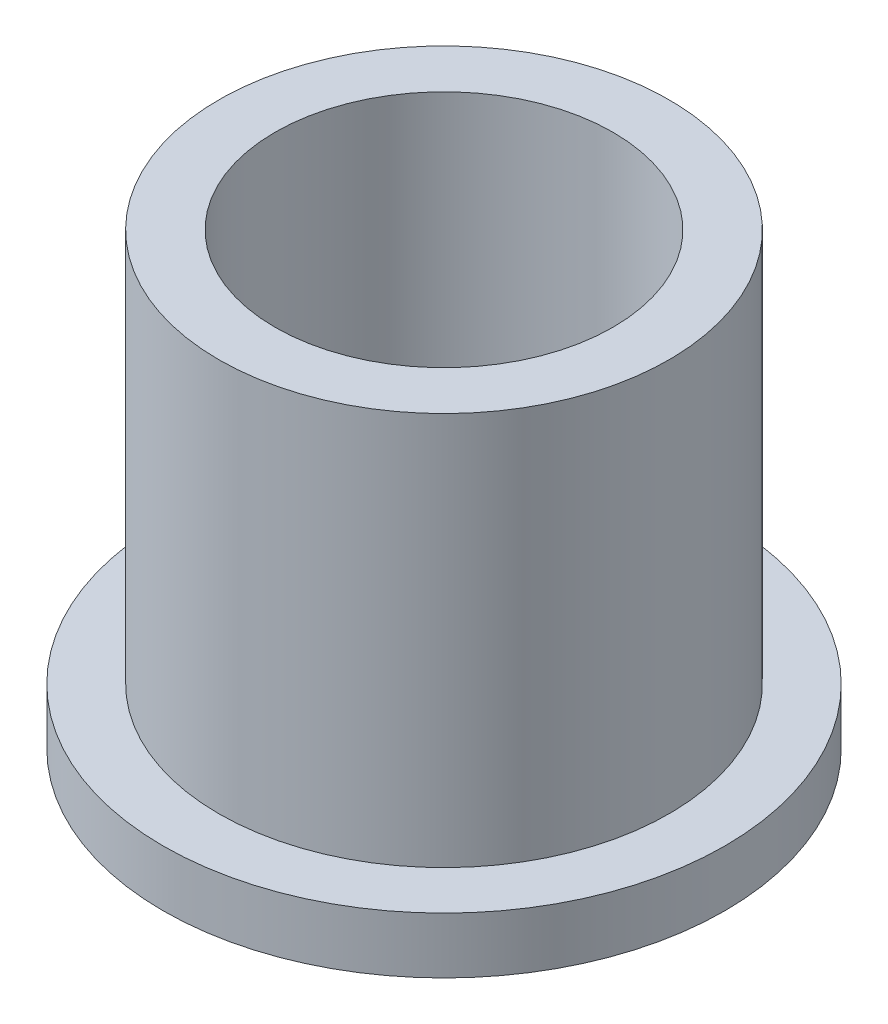
ISO-10303-21;
HEADER;
FILE_DESCRIPTION(('STEP AP214'),'2;1');
FILE_NAME('part.step','',(''),(''),'','','');
FILE_SCHEMA(('AUTOMOTIVE_DESIGN { 1 0 10303 214 1 1 1 1 }'));
ENDSEC;
DATA;
#1=APPLICATION_CONTEXT('core data for automotive mechanical design processes');
#2=APPLICATION_PROTOCOL_DEFINITION('international standard','automotive_design',2000,#1);
#3=PRODUCT_CONTEXT('',#1,'mechanical');
#4=PRODUCT('Part','Part','',(#3));
#5=PRODUCT_RELATED_PRODUCT_CATEGORY('part','',(#4));
#6=PRODUCT_DEFINITION_FORMATION('','',#4);
#7=PRODUCT_DEFINITION_CONTEXT('part definition',#1,'design');
#8=PRODUCT_DEFINITION('design','',#6,#7);
#9=PRODUCT_DEFINITION_SHAPE('','',#8);
#10=(LENGTH_UNIT() NAMED_UNIT(*) SI_UNIT(.MILLI.,.METRE.));
#11=(NAMED_UNIT(*) PLANE_ANGLE_UNIT() SI_UNIT($,.RADIAN.));
#12=(NAMED_UNIT(*) SI_UNIT($,.STERADIAN.) SOLID_ANGLE_UNIT());
#13=UNCERTAINTY_MEASURE_WITH_UNIT(LENGTH_MEASURE(1.E-05),#10,'distance_accuracy_value','');
#14=(GEOMETRIC_REPRESENTATION_CONTEXT(3) GLOBAL_UNCERTAINTY_ASSIGNED_CONTEXT((#13)) GLOBAL_UNIT_ASSIGNED_CONTEXT((#10,
#11,#12)) REPRESENTATION_CONTEXT('',''));
#15=CARTESIAN_POINT('',(0.,0.,0.));
#16=DIRECTION('',(0.,0.,1.));
#17=DIRECTION('',(1.,0.,0.));
#18=AXIS2_PLACEMENT_3D('',#15,#16,#17);
#19=CARTESIAN_POINT('',(0.,12.7,0.));
#20=DIRECTION('',(0.,1.,0.));
#21=DIRECTION('',(0.,0.,1.));
#22=AXIS2_PLACEMENT_3D('',#19,#20,#21);
#23=PLANE('',#22);
#24=CARTESIAN_POINT('',(0.,12.7,0.));
#25=DIRECTION('',(0.,1.,0.));
#26=DIRECTION('',(0.,0.,1.));
#27=AXIS2_PLACEMENT_3D('',#24,#25,#26);
#28=CIRCLE('',#27,6.3627);
#29=CARTESIAN_POINT('',(0.,12.7,6.3627));
#30=VERTEX_POINT('',#29);
#31=EDGE_CURVE('E10',#30,#30,#28,.T.);
#32=ORIENTED_EDGE('',*,*,#31,.T.);
#33=EDGE_LOOP('',(#32));
#34=FACE_BOUND('',#33,.T.);
#35=CARTESIAN_POINT('',(0.,12.7,0.));
#36=DIRECTION('',(0.,1.,0.));
#37=DIRECTION('',(0.,0.,1.));
#38=AXIS2_PLACEMENT_3D('',#35,#36,#37);
#39=CIRCLE('',#38,4.7752);
#40=CARTESIAN_POINT('',(0.,12.7,4.7752));
#41=VERTEX_POINT('',#40);
#42=EDGE_CURVE('E39',#41,#41,#39,.T.);
#43=ORIENTED_EDGE('',*,*,#42,.F.);
#44=EDGE_LOOP('',(#43));
#45=FACE_BOUND('',#44,.T.);
#46=ADVANCED_FACE('F32',(#34,#45),#23,.T.);
#47=CARTESIAN_POINT('',(0.,0.,0.));
#48=DIRECTION('',(0.,1.,0.));
#49=DIRECTION('',(0.,0.,1.));
#50=AXIS2_PLACEMENT_3D('',#47,#48,#49);
#51=PLANE('',#50);
#52=CARTESIAN_POINT('',(0.,0.,0.));
#53=DIRECTION('',(0.,1.,0.));
#54=DIRECTION('',(0.,0.,1.));
#55=AXIS2_PLACEMENT_3D('',#52,#53,#54);
#56=CIRCLE('',#55,4.7752);
#57=CARTESIAN_POINT('',(0.,0.,4.7752));
#58=VERTEX_POINT('',#57);
#59=EDGE_CURVE('E43',#58,#58,#56,.T.);
#60=ORIENTED_EDGE('',*,*,#59,.T.);
#61=EDGE_LOOP('',(#60));
#62=FACE_BOUND('',#61,.T.);
#63=CARTESIAN_POINT('',(0.,0.,0.));
#64=DIRECTION('',(0.,1.,0.));
#65=DIRECTION('',(0.,0.,1.));
#66=AXIS2_PLACEMENT_3D('',#63,#64,#65);
#67=CIRCLE('',#66,7.9375);
#68=CARTESIAN_POINT('',(0.,0.,7.9375));
#69=VERTEX_POINT('',#68);
#70=EDGE_CURVE('E50',#69,#69,#67,.T.);
#71=ORIENTED_EDGE('',*,*,#70,.F.);
#72=EDGE_LOOP('',(#71));
#73=FACE_BOUND('',#72,.T.);
#74=ADVANCED_FACE('F75',(#62,#73),#51,.F.);
#75=CARTESIAN_POINT('',(0.,12.7,0.));
#76=DIRECTION('',(0.,-1.,0.));
#77=DIRECTION('',(0.,0.,-1.));
#78=AXIS2_PLACEMENT_3D('',#75,#76,#77);
#79=CYLINDRICAL_SURFACE('',#78,6.3627);
#80=CARTESIAN_POINT('',(0.,1.5875,0.));
#81=DIRECTION('',(0.,1.,0.));
#82=DIRECTION('',(0.,0.,1.));
#83=AXIS2_PLACEMENT_3D('',#80,#81,#82);
#84=CIRCLE('',#83,6.3627);
#85=CARTESIAN_POINT('',(0.,1.5875,6.3627));
#86=VERTEX_POINT('',#85);
#87=EDGE_CURVE('E53',#86,#86,#84,.T.);
#88=ORIENTED_EDGE('',*,*,#87,.T.);
#89=EDGE_LOOP('',(#88));
#90=FACE_BOUND('',#89,.T.);
#91=ORIENTED_EDGE('',*,*,#31,.F.);
#92=EDGE_LOOP('',(#91));
#93=FACE_BOUND('',#92,.T.);
#94=ADVANCED_FACE('F34',(#90,#93),#79,.T.);
#95=CARTESIAN_POINT('',(0.,12.7,0.));
#96=DIRECTION('',(0.,-1.,0.));
#97=DIRECTION('',(0.,0.,-1.));
#98=AXIS2_PLACEMENT_3D('',#95,#96,#97);
#99=CYLINDRICAL_SURFACE('',#98,4.7752);
#100=ORIENTED_EDGE('',*,*,#42,.T.);
#101=EDGE_LOOP('',(#100));
#102=FACE_BOUND('',#101,.T.);
#103=ORIENTED_EDGE('',*,*,#59,.F.);
#104=EDGE_LOOP('',(#103));
#105=FACE_BOUND('',#104,.T.);
#106=ADVANCED_FACE('F64',(#102,#105),#99,.F.);
#107=CARTESIAN_POINT('',(0.,1.5875,0.));
#108=DIRECTION('',(0.,1.,0.));
#109=DIRECTION('',(0.,0.,1.));
#110=AXIS2_PLACEMENT_3D('',#107,#108,#109);
#111=PLANE('',#110);
#112=CARTESIAN_POINT('',(0.,1.5875,0.));
#113=DIRECTION('',(0.,1.,0.));
#114=DIRECTION('',(0.,0.,1.));
#115=AXIS2_PLACEMENT_3D('',#112,#113,#114);
#116=CIRCLE('',#115,7.9375);
#117=CARTESIAN_POINT('',(0.,1.5875,7.9375));
#118=VERTEX_POINT('',#117);
#119=EDGE_CURVE('E48',#118,#118,#116,.T.);
#120=ORIENTED_EDGE('',*,*,#119,.T.);
#121=EDGE_LOOP('',(#120));
#122=FACE_BOUND('',#121,.T.);
#123=ORIENTED_EDGE('',*,*,#87,.F.);
#124=EDGE_LOOP('',(#123));
#125=FACE_BOUND('',#124,.T.);
#126=ADVANCED_FACE('F61',(#122,#125),#111,.T.);
#127=CARTESIAN_POINT('',(0.,1.5875,0.));
#128=DIRECTION('',(0.,-1.,0.));
#129=DIRECTION('',(0.,0.,-1.));
#130=AXIS2_PLACEMENT_3D('',#127,#128,#129);
#131=CYLINDRICAL_SURFACE('',#130,7.9375);
#132=ORIENTED_EDGE('',*,*,#119,.F.);
#133=EDGE_LOOP('',(#132));
#134=FACE_BOUND('',#133,.T.);
#135=ORIENTED_EDGE('',*,*,#70,.T.);
#136=EDGE_LOOP('',(#135));
#137=FACE_BOUND('',#136,.T.);
#138=ADVANCED_FACE('F63',(#134,#137),#131,.T.);
#139=CLOSED_SHELL('',(#46,#74,#94,#106,#126,#138));
#140=MANIFOLD_SOLID_BREP('B2',#139);
#141=ADVANCED_BREP_SHAPE_REPRESENTATION('',(#18,#140),#14);
#142=SHAPE_DEFINITION_REPRESENTATION(#9,#141);
ENDSEC;
END-ISO-10303-21;
